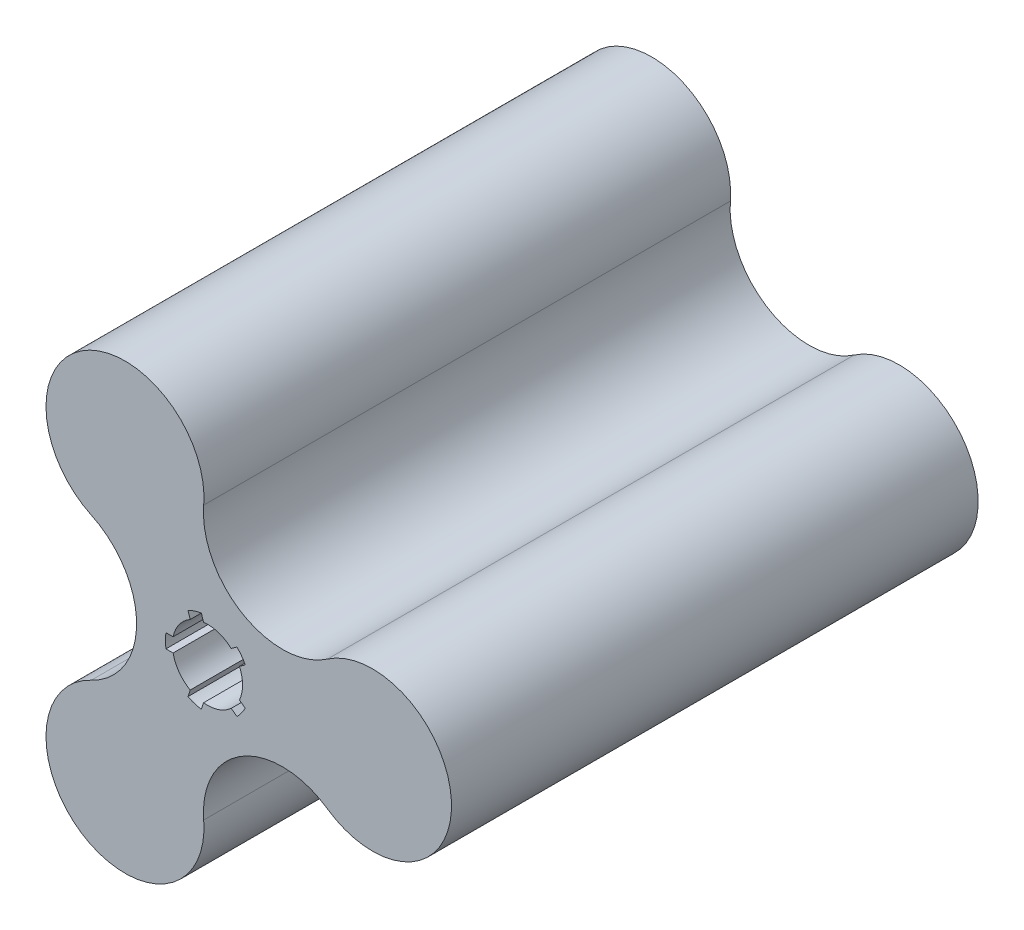
ISO-10303-21;
HEADER;
FILE_DESCRIPTION(('STEP AP214'),'2;1');
FILE_NAME('part.step','',(''),(''),'','','');
FILE_SCHEMA(('AUTOMOTIVE_DESIGN { 1 0 10303 214 1 1 1 1 }'));
ENDSEC;
DATA;
#1=APPLICATION_CONTEXT('core data for automotive mechanical design processes');
#2=APPLICATION_PROTOCOL_DEFINITION('international standard','automotive_design',2000,#1);
#3=PRODUCT_CONTEXT('',#1,'mechanical');
#4=PRODUCT('Part','Part','',(#3));
#5=PRODUCT_RELATED_PRODUCT_CATEGORY('part','',(#4));
#6=PRODUCT_DEFINITION_FORMATION('','',#4);
#7=PRODUCT_DEFINITION_CONTEXT('part definition',#1,'design');
#8=PRODUCT_DEFINITION('design','',#6,#7);
#9=PRODUCT_DEFINITION_SHAPE('','',#8);
#10=(LENGTH_UNIT() NAMED_UNIT(*) SI_UNIT(.MILLI.,.METRE.));
#11=(NAMED_UNIT(*) PLANE_ANGLE_UNIT() SI_UNIT($,.RADIAN.));
#12=(NAMED_UNIT(*) SI_UNIT($,.STERADIAN.) SOLID_ANGLE_UNIT());
#13=UNCERTAINTY_MEASURE_WITH_UNIT(LENGTH_MEASURE(1.E-05),#10,'distance_accuracy_value','');
#14=(GEOMETRIC_REPRESENTATION_CONTEXT(3) GLOBAL_UNCERTAINTY_ASSIGNED_CONTEXT((#13)) GLOBAL_UNIT_ASSIGNED_CONTEXT((#10,
#11,#12)) REPRESENTATION_CONTEXT('',''));
#15=CARTESIAN_POINT('',(0.,0.,0.));
#16=DIRECTION('',(0.,0.,1.));
#17=DIRECTION('',(1.,0.,0.));
#18=AXIS2_PLACEMENT_3D('',#15,#16,#17);
#19=CARTESIAN_POINT('',(47.,0.,-150.));
#20=DIRECTION('',(0.,0.,1.));
#21=DIRECTION('',(1.,0.,0.));
#22=AXIS2_PLACEMENT_3D('',#19,#20,#21);
#23=CYLINDRICAL_SURFACE('',#22,22.5);
#24=CARTESIAN_POINT('',(47.,0.,0.));
#25=DIRECTION('',(0.,0.,1.));
#26=DIRECTION('',(1.,0.,0.));
#27=AXIS2_PLACEMENT_3D('',#24,#25,#26);
#28=CIRCLE('',#27,22.5);
#29=CARTESIAN_POINT('',(34.1724602655989,-18.4852434217773,0.));
#30=VERTEX_POINT('',#29);
#31=CARTESIAN_POINT('',(34.1724602655988,18.4852434217772,0.));
#32=VERTEX_POINT('',#31);
#33=EDGE_CURVE('E313',#30,#32,#28,.T.);
#34=ORIENTED_EDGE('',*,*,#33,.F.);
#35=DIRECTION('',(0.,0.,1.));
#36=VECTOR('',#35,1.);
#37=CARTESIAN_POINT('',(34.1724602655989,-18.4852434217773,-150.));
#38=LINE('',#37,#36);
#39=CARTESIAN_POINT('',(34.1724602655989,-18.4852434217773,-150.));
#40=VERTEX_POINT('',#39);
#41=EDGE_CURVE('E11',#40,#30,#38,.T.);
#42=ORIENTED_EDGE('',*,*,#41,.F.);
#43=CARTESIAN_POINT('',(47.,0.,-150.));
#44=DIRECTION('',(0.,0.,1.));
#45=DIRECTION('',(1.,0.,0.));
#46=AXIS2_PLACEMENT_3D('',#43,#44,#45);
#47=CIRCLE('',#46,22.5);
#48=CARTESIAN_POINT('',(34.1724602655988,18.4852434217772,-150.));
#49=VERTEX_POINT('',#48);
#50=EDGE_CURVE('E572',#40,#49,#47,.T.);
#51=ORIENTED_EDGE('',*,*,#50,.T.);
#52=DIRECTION('',(0.,0.,1.));
#53=VECTOR('',#52,1.);
#54=CARTESIAN_POINT('',(34.1724602655988,18.4852434217772,-150.));
#55=LINE('',#54,#53);
#56=EDGE_CURVE('E342',#49,#32,#55,.T.);
#57=ORIENTED_EDGE('',*,*,#56,.T.);
#58=EDGE_LOOP('',(#34,#42,#51,#57));
#59=FACE_BOUND('',#58,.T.);
#60=ADVANCED_FACE('F45',(#59),#23,.T.);
#61=CARTESIAN_POINT('',(21.3449205311978,-36.9704868435546,-150.));
#62=DIRECTION('',(0.,0.,1.));
#63=DIRECTION('',(1.,0.,0.));
#64=AXIS2_PLACEMENT_3D('',#61,#62,#63);
#65=CYLINDRICAL_SURFACE('',#64,22.5);
#66=CARTESIAN_POINT('',(21.3449205311978,-36.9704868435546,0.));
#67=DIRECTION('',(0.,0.,1.));
#68=DIRECTION('',(1.,0.,0.));
#69=AXIS2_PLACEMENT_3D('',#66,#67,#68);
#70=CIRCLE('',#69,22.5);
#71=CARTESIAN_POINT('',(-1.07753973440112,-38.8368404107116,0.));
#72=VERTEX_POINT('',#71);
#73=EDGE_CURVE('E330',#72,#30,#70,.F.);
#74=ORIENTED_EDGE('',*,*,#73,.F.);
#75=DIRECTION('',(0.,0.,1.));
#76=VECTOR('',#75,1.);
#77=CARTESIAN_POINT('',(-1.07753973440112,-38.8368404107116,-150.));
#78=LINE('',#77,#76);
#79=CARTESIAN_POINT('',(-1.07753973440112,-38.8368404107116,-150.));
#80=VERTEX_POINT('',#79);
#81=EDGE_CURVE('E56',#80,#72,#78,.T.);
#82=ORIENTED_EDGE('',*,*,#81,.F.);
#83=CARTESIAN_POINT('',(21.3449205311978,-36.9704868435546,-150.));
#84=DIRECTION('',(0.,0.,1.));
#85=DIRECTION('',(1.,0.,0.));
#86=AXIS2_PLACEMENT_3D('',#83,#84,#85);
#87=CIRCLE('',#86,22.5);
#88=EDGE_CURVE('E247',#80,#40,#87,.F.);
#89=ORIENTED_EDGE('',*,*,#88,.T.);
#90=ORIENTED_EDGE('',*,*,#41,.T.);
#91=EDGE_LOOP('',(#74,#82,#89,#90));
#92=FACE_BOUND('',#91,.T.);
#93=ADVANCED_FACE('F439',(#92),#65,.F.);
#94=CARTESIAN_POINT('',(-23.5,-40.7031939778687,-150.));
#95=DIRECTION('',(0.,0.,1.));
#96=DIRECTION('',(1.,0.,0.));
#97=AXIS2_PLACEMENT_3D('',#94,#95,#96);
#98=CYLINDRICAL_SURFACE('',#97,22.5);
#99=CARTESIAN_POINT('',(-23.5,-40.7031939778687,0.));
#100=DIRECTION('',(0.,0.,1.));
#101=DIRECTION('',(1.,0.,0.));
#102=AXIS2_PLACEMENT_3D('',#99,#100,#101);
#103=CIRCLE('',#102,22.5);
#104=CARTESIAN_POINT('',(-33.0949205311977,-20.3515969889344,0.));
#105=VERTEX_POINT('',#104);
#106=EDGE_CURVE('E230',#105,#72,#103,.T.);
#107=ORIENTED_EDGE('',*,*,#106,.F.);
#108=DIRECTION('',(0.,0.,1.));
#109=VECTOR('',#108,1.);
#110=CARTESIAN_POINT('',(-33.0949205311977,-20.3515969889344,-150.));
#111=LINE('',#110,#109);
#112=CARTESIAN_POINT('',(-33.0949205311977,-20.3515969889344,-150.));
#113=VERTEX_POINT('',#112);
#114=EDGE_CURVE('E224',#113,#105,#111,.T.);
#115=ORIENTED_EDGE('',*,*,#114,.F.);
#116=CARTESIAN_POINT('',(-23.5,-40.7031939778687,-150.));
#117=DIRECTION('',(0.,0.,1.));
#118=DIRECTION('',(1.,0.,0.));
#119=AXIS2_PLACEMENT_3D('',#116,#117,#118);
#120=CIRCLE('',#119,22.5);
#121=EDGE_CURVE('E228',#113,#80,#120,.T.);
#122=ORIENTED_EDGE('',*,*,#121,.T.);
#123=ORIENTED_EDGE('',*,*,#81,.T.);
#124=EDGE_LOOP('',(#107,#115,#122,#123));
#125=FACE_BOUND('',#124,.T.);
#126=ADVANCED_FACE('F226',(#125),#98,.T.);
#127=CARTESIAN_POINT('',(-42.6898410623955,0.,-150.));
#128=DIRECTION('',(0.,0.,1.));
#129=DIRECTION('',(1.,0.,0.));
#130=AXIS2_PLACEMENT_3D('',#127,#128,#129);
#131=CYLINDRICAL_SURFACE('',#130,22.5);
#132=CARTESIAN_POINT('',(-42.6898410623955,0.,0.));
#133=DIRECTION('',(0.,0.,1.));
#134=DIRECTION('',(1.,0.,0.));
#135=AXIS2_PLACEMENT_3D('',#132,#133,#134);
#136=CIRCLE('',#135,22.5);
#137=CARTESIAN_POINT('',(-33.0949205311978,20.3515969889343,0.));
#138=VERTEX_POINT('',#137);
#139=EDGE_CURVE('E325',#105,#138,#136,.T.);
#140=ORIENTED_EDGE('',*,*,#139,.T.);
#141=DIRECTION('',(0.,0.,1.));
#142=VECTOR('',#141,1.);
#143=CARTESIAN_POINT('',(-33.0949205311978,20.3515969889343,-150.));
#144=LINE('',#143,#142);
#145=CARTESIAN_POINT('',(-33.0949205311978,20.3515969889343,-150.));
#146=VERTEX_POINT('',#145);
#147=EDGE_CURVE('E235',#146,#138,#144,.T.);
#148=ORIENTED_EDGE('',*,*,#147,.F.);
#149=CARTESIAN_POINT('',(-42.6898410623955,0.,-150.));
#150=DIRECTION('',(0.,0.,1.));
#151=DIRECTION('',(1.,0.,0.));
#152=AXIS2_PLACEMENT_3D('',#149,#150,#151);
#153=CIRCLE('',#152,22.5);
#154=EDGE_CURVE('E238',#113,#146,#153,.T.);
#155=ORIENTED_EDGE('',*,*,#154,.F.);
#156=ORIENTED_EDGE('',*,*,#114,.T.);
#157=EDGE_LOOP('',(#140,#148,#155,#156));
#158=FACE_BOUND('',#157,.T.);
#159=ADVANCED_FACE('F239',(#158),#131,.F.);
#160=CARTESIAN_POINT('',(-23.5000000000001,40.7031939778686,-150.));
#161=DIRECTION('',(0.,0.,1.));
#162=DIRECTION('',(1.,0.,0.));
#163=AXIS2_PLACEMENT_3D('',#160,#161,#162);
#164=CYLINDRICAL_SURFACE('',#163,22.5);
#165=CARTESIAN_POINT('',(-23.5000000000001,40.7031939778686,0.));
#166=DIRECTION('',(0.,0.,1.));
#167=DIRECTION('',(1.,0.,0.));
#168=AXIS2_PLACEMENT_3D('',#165,#166,#167);
#169=CIRCLE('',#168,22.5);
#170=CARTESIAN_POINT('',(-1.0775397344012,38.8368404107115,0.));
#171=VERTEX_POINT('',#170);
#172=EDGE_CURVE('E321',#171,#138,#169,.T.);
#173=ORIENTED_EDGE('',*,*,#172,.F.);
#174=DIRECTION('',(0.,0.,1.));
#175=VECTOR('',#174,1.);
#176=CARTESIAN_POINT('',(-1.0775397344012,38.8368404107115,-150.));
#177=LINE('',#176,#175);
#178=CARTESIAN_POINT('',(-1.0775397344012,38.8368404107115,-150.));
#179=VERTEX_POINT('',#178);
#180=EDGE_CURVE('E339',#179,#171,#177,.T.);
#181=ORIENTED_EDGE('',*,*,#180,.F.);
#182=CARTESIAN_POINT('',(-23.5000000000001,40.7031939778686,-150.));
#183=DIRECTION('',(0.,0.,1.));
#184=DIRECTION('',(1.,0.,0.));
#185=AXIS2_PLACEMENT_3D('',#182,#183,#184);
#186=CIRCLE('',#185,22.5);
#187=EDGE_CURVE('E244',#179,#146,#186,.T.);
#188=ORIENTED_EDGE('',*,*,#187,.T.);
#189=ORIENTED_EDGE('',*,*,#147,.T.);
#190=EDGE_LOOP('',(#173,#181,#188,#189));
#191=FACE_BOUND('',#190,.T.);
#192=ADVANCED_FACE('F581',(#191),#164,.T.);
#193=CARTESIAN_POINT('',(0.,0.,-150.));
#194=DIRECTION('',(0.,0.,1.));
#195=DIRECTION('',(1.,0.,0.));
#196=AXIS2_PLACEMENT_3D('',#193,#194,#195);
#197=CYLINDRICAL_SURFACE('',#196,12.);
#198=CARTESIAN_POINT('',(0.,0.,0.));
#199=DIRECTION('',(0.,0.,1.));
#200=DIRECTION('',(1.,0.,0.));
#201=AXIS2_PLACEMENT_3D('',#198,#199,#200);
#202=CIRCLE('',#201,12.);
#203=CARTESIAN_POINT('',(-5.5584514187021,-10.6350184685279,0.));
#204=VERTEX_POINT('',#203);
#205=CARTESIAN_POINT('',(-1.7542253535215,-11.8710864460277,0.));
#206=VERTEX_POINT('',#205);
#207=EDGE_CURVE('E254',#204,#206,#202,.T.);
#208=ORIENTED_EDGE('',*,*,#207,.T.);
#209=DIRECTION('',(0.,0.,1.));
#210=VECTOR('',#209,1.);
#211=CARTESIAN_POINT('',(-1.7542253535215,-11.8710864460277,-150.));
#212=LINE('',#211,#210);
#213=CARTESIAN_POINT('',(-1.7542253535215,-11.8710864460277,-150.));
#214=VERTEX_POINT('',#213);
#215=EDGE_CURVE('E345',#214,#206,#212,.T.);
#216=ORIENTED_EDGE('',*,*,#215,.F.);
#217=CARTESIAN_POINT('',(0.,0.,-150.));
#218=DIRECTION('',(0.,0.,1.));
#219=DIRECTION('',(1.,0.,0.));
#220=AXIS2_PLACEMENT_3D('',#217,#218,#219);
#221=CIRCLE('',#220,12.);
#222=CARTESIAN_POINT('',(-5.5584514187021,-10.6350184685279,-150.));
#223=VERTEX_POINT('',#222);
#224=EDGE_CURVE('E333',#223,#214,#221,.T.);
#225=ORIENTED_EDGE('',*,*,#224,.F.);
#226=DIRECTION('',(0.,0.,1.));
#227=VECTOR('',#226,1.);
#228=CARTESIAN_POINT('',(-5.5584514187021,-10.6350184685279,-150.));
#229=LINE('',#228,#227);
#230=EDGE_CURVE('E49',#223,#204,#229,.T.);
#231=ORIENTED_EDGE('',*,*,#230,.T.);
#232=EDGE_LOOP('',(#208,#216,#225,#231));
#233=FACE_BOUND('',#232,.T.);
#234=ADVANCED_FACE('F47',(#233),#197,.F.);
#235=CARTESIAN_POINT('',(1.9021130325903,-0.618033988749915,-150.));
#236=DIRECTION('',(0.95105651629515,-0.309016994374958,0.));
#237=DIRECTION('',(0.309016994374958,0.95105651629515,0.));
#238=AXIS2_PLACEMENT_3D('',#235,#236,#237);
#239=PLANE('',#238);
#240=DIRECTION('',(0.309016994374958,0.95105651629515,0.));
#241=VECTOR('',#240,1.);
#242=CARTESIAN_POINT('',(1.9021130325903,-0.618033988749915,0.));
#243=LINE('',#242,#241);
#244=CARTESIAN_POINT('',(-1.12562279967829,-9.93644671463821,0.));
#245=VERTEX_POINT('',#244);
#246=EDGE_CURVE('E310',#206,#245,#243,.T.);
#247=ORIENTED_EDGE('',*,*,#246,.T.);
#248=DIRECTION('',(0.,0.,1.));
#249=VECTOR('',#248,1.);
#250=CARTESIAN_POINT('',(-1.12562279967829,-9.93644671463821,-150.));
#251=LINE('',#250,#249);
#252=CARTESIAN_POINT('',(-1.12562279967829,-9.93644671463821,-150.));
#253=VERTEX_POINT('',#252);
#254=EDGE_CURVE('E349',#253,#245,#251,.T.);
#255=ORIENTED_EDGE('',*,*,#254,.F.);
#256=DIRECTION('',(0.309016994374958,0.95105651629515,0.));
#257=VECTOR('',#256,1.);
#258=CARTESIAN_POINT('',(1.9021130325903,-0.618033988749915,-150.));
#259=LINE('',#258,#257);
#260=EDGE_CURVE('E522',#214,#253,#259,.T.);
#261=ORIENTED_EDGE('',*,*,#260,.F.);
#262=ORIENTED_EDGE('',*,*,#215,.T.);
#263=EDGE_LOOP('',(#247,#255,#261,#262));
#264=FACE_BOUND('',#263,.T.);
#265=ADVANCED_FACE('F447',(#264),#239,.F.);
#266=CARTESIAN_POINT('',(0.,0.,-150.));
#267=DIRECTION('',(0.,0.,1.));
#268=DIRECTION('',(1.,0.,0.));
#269=AXIS2_PLACEMENT_3D('',#266,#267,#268);
#270=CYLINDRICAL_SURFACE('',#269,10.);
#271=CARTESIAN_POINT('',(0.,0.,0.));
#272=DIRECTION('',(0.,0.,1.));
#273=DIRECTION('',(1.,0.,0.));
#274=AXIS2_PLACEMENT_3D('',#271,#272,#273);
#275=CIRCLE('',#274,10.);
#276=CARTESIAN_POINT('',(6.75114481324983,-7.3771297745485,0.));
#277=VERTEX_POINT('',#276);
#278=EDGE_CURVE('E267',#245,#277,#275,.T.);
#279=ORIENTED_EDGE('',*,*,#278,.T.);
#280=DIRECTION('',(0.,0.,1.));
#281=VECTOR('',#280,1.);
#282=CARTESIAN_POINT('',(6.75114481324983,-7.3771297745485,-150.));
#283=LINE('',#282,#281);
#284=CARTESIAN_POINT('',(6.75114481324983,-7.3771297745485,-150.));
#285=VERTEX_POINT('',#284);
#286=EDGE_CURVE('E353',#285,#277,#283,.T.);
#287=ORIENTED_EDGE('',*,*,#286,.F.);
#288=CARTESIAN_POINT('',(0.,0.,-150.));
#289=DIRECTION('',(0.,0.,1.));
#290=DIRECTION('',(1.,0.,0.));
#291=AXIS2_PLACEMENT_3D('',#288,#289,#290);
#292=CIRCLE('',#291,10.);
#293=EDGE_CURVE('E514',#253,#285,#292,.T.);
#294=ORIENTED_EDGE('',*,*,#293,.F.);
#295=ORIENTED_EDGE('',*,*,#254,.T.);
#296=EDGE_LOOP('',(#279,#287,#294,#295));
#297=FACE_BOUND('',#296,.T.);
#298=ADVANCED_FACE('F436',(#297),#270,.F.);
#299=CARTESIAN_POINT('',(-1.17557050458496,-1.61803398874989,-150.));
#300=DIRECTION('',(0.58778525229248,0.809016994374942,0.));
#301=DIRECTION('',(-0.809016994374943,0.58778525229248,0.));
#302=AXIS2_PLACEMENT_3D('',#299,#300,#301);
#303=PLANE('',#302);
#304=DIRECTION('',(-0.809016994374943,0.58778525229248,0.));
#305=VECTOR('',#304,1.);
#306=CARTESIAN_POINT('',(-1.17557050458496,-1.61803398874989,0.));
#307=LINE('',#306,#305);
#308=CARTESIAN_POINT('',(8.39684766462627,-8.57280288453319,0.));
#309=VERTEX_POINT('',#308);
#310=EDGE_CURVE('E306',#309,#277,#307,.T.);
#311=ORIENTED_EDGE('',*,*,#310,.F.);
#312=DIRECTION('',(0.,0.,1.));
#313=VECTOR('',#312,1.);
#314=CARTESIAN_POINT('',(8.39684766462627,-8.57280288453319,-150.));
#315=LINE('',#314,#313);
#316=CARTESIAN_POINT('',(8.39684766462627,-8.57280288453319,-150.));
#317=VERTEX_POINT('',#316);
#318=EDGE_CURVE('E356',#317,#309,#315,.T.);
#319=ORIENTED_EDGE('',*,*,#318,.F.);
#320=DIRECTION('',(-0.809016994374943,0.58778525229248,0.));
#321=VECTOR('',#320,1.);
#322=CARTESIAN_POINT('',(-1.17557050458496,-1.61803398874989,-150.));
#323=LINE('',#322,#321);
#324=EDGE_CURVE('E523',#317,#285,#323,.T.);
#325=ORIENTED_EDGE('',*,*,#324,.T.);
#326=ORIENTED_EDGE('',*,*,#286,.T.);
#327=EDGE_LOOP('',(#311,#319,#325,#326));
#328=FACE_BOUND('',#327,.T.);
#329=ADVANCED_FACE('F452',(#328),#303,.T.);
#330=CARTESIAN_POINT('',(0.,0.,-150.));
#331=DIRECTION('',(0.,0.,1.));
#332=DIRECTION('',(1.,0.,0.));
#333=AXIS2_PLACEMENT_3D('',#330,#331,#332);
#334=CYLINDRICAL_SURFACE('',#333,12.);
#335=CARTESIAN_POINT('',(0.,0.,0.));
#336=DIRECTION('',(0.,0.,1.));
#337=DIRECTION('',(1.,0.,0.));
#338=AXIS2_PLACEMENT_3D('',#335,#336,#337);
#339=CIRCLE('',#338,12.);
#340=CARTESIAN_POINT('',(10.7479886737962,-5.33673490703342,0.));
#341=VERTEX_POINT('',#340);
#342=EDGE_CURVE('E303',#309,#341,#339,.T.);
#343=ORIENTED_EDGE('',*,*,#342,.T.);
#344=DIRECTION('',(0.,0.,1.));
#345=VECTOR('',#344,1.);
#346=CARTESIAN_POINT('',(10.7479886737962,-5.33673490703342,-150.));
#347=LINE('',#346,#345);
#348=CARTESIAN_POINT('',(10.7479886737962,-5.33673490703342,-150.));
#349=VERTEX_POINT('',#348);
#350=EDGE_CURVE('E359',#349,#341,#347,.T.);
#351=ORIENTED_EDGE('',*,*,#350,.F.);
#352=CARTESIAN_POINT('',(0.,0.,-150.));
#353=DIRECTION('',(0.,0.,1.));
#354=DIRECTION('',(1.,0.,0.));
#355=AXIS2_PLACEMENT_3D('',#352,#353,#354);
#356=CIRCLE('',#355,12.);
#357=EDGE_CURVE('E558',#317,#349,#356,.T.);
#358=ORIENTED_EDGE('',*,*,#357,.F.);
#359=ORIENTED_EDGE('',*,*,#318,.T.);
#360=EDGE_LOOP('',(#343,#351,#358,#359));
#361=FACE_BOUND('',#360,.T.);
#362=ADVANCED_FACE('F457',(#361),#334,.F.);
#363=CARTESIAN_POINT('',(1.17557050458496,1.61803398874988,-150.));
#364=DIRECTION('',(0.58778525229248,0.809016994374942,0.));
#365=DIRECTION('',(-0.809016994374942,0.58778525229248,0.));
#366=AXIS2_PLACEMENT_3D('',#363,#364,#365);
#367=PLANE('',#366);
#368=DIRECTION('',(-0.809016994374942,0.58778525229248,0.));
#369=VECTOR('',#368,1.);
#370=CARTESIAN_POINT('',(1.17557050458496,1.61803398874988,0.));
#371=LINE('',#370,#369);
#372=CARTESIAN_POINT('',(9.10228582241975,-4.14106179704873,0.));
#373=VERTEX_POINT('',#372);
#374=EDGE_CURVE('E300',#341,#373,#371,.T.);
#375=ORIENTED_EDGE('',*,*,#374,.T.);
#376=DIRECTION('',(0.,0.,1.));
#377=VECTOR('',#376,1.);
#378=CARTESIAN_POINT('',(9.10228582241975,-4.14106179704873,-150.));
#379=LINE('',#378,#377);
#380=CARTESIAN_POINT('',(9.10228582241975,-4.14106179704873,-150.));
#381=VERTEX_POINT('',#380);
#382=EDGE_CURVE('E363',#381,#373,#379,.T.);
#383=ORIENTED_EDGE('',*,*,#382,.F.);
#384=DIRECTION('',(-0.809016994374942,0.58778525229248,0.));
#385=VECTOR('',#384,1.);
#386=CARTESIAN_POINT('',(1.17557050458496,1.61803398874988,-150.));
#387=LINE('',#386,#385);
#388=EDGE_CURVE('E551',#349,#381,#387,.T.);
#389=ORIENTED_EDGE('',*,*,#388,.F.);
#390=ORIENTED_EDGE('',*,*,#350,.T.);
#391=EDGE_LOOP('',(#375,#383,#389,#390));
#392=FACE_BOUND('',#391,.T.);
#393=ADVANCED_FACE('F461',(#392),#367,.F.);
#394=CARTESIAN_POINT('',(9.10228582241981,4.1410617970486,0.));
#395=VERTEX_POINT('',#394);
#396=EDGE_CURVE('E299',#373,#395,#275,.T.);
#397=ORIENTED_EDGE('',*,*,#396,.T.);
#398=DIRECTION('',(0.,0.,1.));
#399=VECTOR('',#398,1.);
#400=CARTESIAN_POINT('',(9.10228582241981,4.1410617970486,-150.));
#401=LINE('',#400,#399);
#402=CARTESIAN_POINT('',(9.10228582241981,4.1410617970486,-150.));
#403=VERTEX_POINT('',#402);
#404=EDGE_CURVE('E367',#403,#395,#401,.T.);
#405=ORIENTED_EDGE('',*,*,#404,.F.);
#406=EDGE_CURVE('E524',#381,#403,#292,.T.);
#407=ORIENTED_EDGE('',*,*,#406,.F.);
#408=ORIENTED_EDGE('',*,*,#382,.T.);
#409=EDGE_LOOP('',(#397,#405,#407,#408));
#410=FACE_BOUND('',#409,.T.);
#411=ADVANCED_FACE('F454',(#410),#270,.F.);
#412=CARTESIAN_POINT('',(1.17557050458494,-1.6180339887499,-150.));
#413=DIRECTION('',(-0.587785252292469,0.809016994374951,0.));
#414=DIRECTION('',(-0.809016994374951,-0.587785252292469,0.));
#415=AXIS2_PLACEMENT_3D('',#412,#413,#414);
#416=PLANE('',#415);
#417=DIRECTION('',(-0.809016994374951,-0.587785252292469,0.));
#418=VECTOR('',#417,1.);
#419=CARTESIAN_POINT('',(1.17557050458494,-1.6180339887499,0.));
#420=LINE('',#419,#418);
#421=CARTESIAN_POINT('',(10.7479886737963,5.33673490703326,0.));
#422=VERTEX_POINT('',#421);
#423=EDGE_CURVE('E295',#422,#395,#420,.T.);
#424=ORIENTED_EDGE('',*,*,#423,.F.);
#425=DIRECTION('',(0.,0.,1.));
#426=VECTOR('',#425,1.);
#427=CARTESIAN_POINT('',(10.7479886737963,5.33673490703326,-150.));
#428=LINE('',#427,#426);
#429=CARTESIAN_POINT('',(10.7479886737963,5.33673490703326,-150.));
#430=VERTEX_POINT('',#429);
#431=EDGE_CURVE('E370',#430,#422,#428,.T.);
#432=ORIENTED_EDGE('',*,*,#431,.F.);
#433=DIRECTION('',(-0.809016994374951,-0.587785252292469,0.));
#434=VECTOR('',#433,1.);
#435=CARTESIAN_POINT('',(1.17557050458494,-1.6180339887499,-150.));
#436=LINE('',#435,#434);
#437=EDGE_CURVE('E552',#430,#403,#436,.T.);
#438=ORIENTED_EDGE('',*,*,#437,.T.);
#439=ORIENTED_EDGE('',*,*,#404,.T.);
#440=EDGE_LOOP('',(#424,#432,#438,#439));
#441=FACE_BOUND('',#440,.T.);
#442=ADVANCED_FACE('F466',(#441),#416,.T.);
#443=CARTESIAN_POINT('',(0.,0.,-150.));
#444=DIRECTION('',(0.,0.,1.));
#445=DIRECTION('',(1.,0.,0.));
#446=AXIS2_PLACEMENT_3D('',#443,#444,#445);
#447=CYLINDRICAL_SURFACE('',#446,12.);
#448=CARTESIAN_POINT('',(0.,0.,0.));
#449=DIRECTION('',(0.,0.,1.));
#450=DIRECTION('',(1.,0.,0.));
#451=AXIS2_PLACEMENT_3D('',#448,#449,#450);
#452=CIRCLE('',#451,12.);
#453=CARTESIAN_POINT('',(8.39684766462639,8.57280288453306,0.));
#454=VERTEX_POINT('',#453);
#455=EDGE_CURVE('E292',#422,#454,#452,.T.);
#456=ORIENTED_EDGE('',*,*,#455,.T.);
#457=DIRECTION('',(0.,0.,1.));
#458=VECTOR('',#457,1.);
#459=CARTESIAN_POINT('',(8.39684766462639,8.57280288453306,-150.));
#460=LINE('',#459,#458);
#461=CARTESIAN_POINT('',(8.39684766462639,8.57280288453306,-150.));
#462=VERTEX_POINT('',#461);
#463=EDGE_CURVE('E373',#462,#454,#460,.T.);
#464=ORIENTED_EDGE('',*,*,#463,.F.);
#465=CARTESIAN_POINT('',(0.,0.,-150.));
#466=DIRECTION('',(0.,0.,1.));
#467=DIRECTION('',(1.,0.,0.));
#468=AXIS2_PLACEMENT_3D('',#465,#466,#467);
#469=CIRCLE('',#468,12.);
#470=EDGE_CURVE('E546',#430,#462,#469,.T.);
#471=ORIENTED_EDGE('',*,*,#470,.F.);
#472=ORIENTED_EDGE('',*,*,#431,.T.);
#473=EDGE_LOOP('',(#456,#464,#471,#472));
#474=FACE_BOUND('',#473,.T.);
#475=ADVANCED_FACE('F469',(#474),#447,.F.);
#476=CARTESIAN_POINT('',(-1.17557050458494,1.61803398874991,-150.));
#477=DIRECTION('',(-0.587785252292468,0.809016994374951,0.));
#478=DIRECTION('',(-0.809016994374951,-0.587785252292468,0.));
#479=AXIS2_PLACEMENT_3D('',#476,#477,#478);
#480=PLANE('',#479);
#481=DIRECTION('',(-0.809016994374951,-0.587785252292468,0.));
#482=VECTOR('',#481,1.);
#483=CARTESIAN_POINT('',(-1.17557050458494,1.61803398874991,0.));
#484=LINE('',#483,#482);
#485=CARTESIAN_POINT('',(6.75114481324994,7.3771297745484,0.));
#486=VERTEX_POINT('',#485);
#487=EDGE_CURVE('E289',#454,#486,#484,.T.);
#488=ORIENTED_EDGE('',*,*,#487,.T.);
#489=DIRECTION('',(0.,0.,1.));
#490=VECTOR('',#489,1.);
#491=CARTESIAN_POINT('',(6.75114481324994,7.3771297745484,-150.));
#492=LINE('',#491,#490);
#493=CARTESIAN_POINT('',(6.75114481324994,7.3771297745484,-150.));
#494=VERTEX_POINT('',#493);
#495=EDGE_CURVE('E377',#494,#486,#492,.T.);
#496=ORIENTED_EDGE('',*,*,#495,.F.);
#497=DIRECTION('',(-0.809016994374951,-0.587785252292468,0.));
#498=VECTOR('',#497,1.);
#499=CARTESIAN_POINT('',(-1.17557050458494,1.61803398874991,-150.));
#500=LINE('',#499,#498);
#501=EDGE_CURVE('E539',#462,#494,#500,.T.);
#502=ORIENTED_EDGE('',*,*,#501,.F.);
#503=ORIENTED_EDGE('',*,*,#463,.T.);
#504=EDGE_LOOP('',(#488,#496,#502,#503));
#505=FACE_BOUND('',#504,.T.);
#506=ADVANCED_FACE('F473',(#505),#480,.F.);
#507=CARTESIAN_POINT('',(-1.12562279967815,9.93644671463823,0.));
#508=VERTEX_POINT('',#507);
#509=EDGE_CURVE('E288',#486,#508,#275,.T.);
#510=ORIENTED_EDGE('',*,*,#509,.T.);
#511=DIRECTION('',(0.,0.,1.));
#512=VECTOR('',#511,1.);
#513=CARTESIAN_POINT('',(-1.12562279967815,9.93644671463823,-150.));
#514=LINE('',#513,#512);
#515=CARTESIAN_POINT('',(-1.12562279967815,9.93644671463823,-150.));
#516=VERTEX_POINT('',#515);
#517=EDGE_CURVE('E381',#516,#508,#514,.T.);
#518=ORIENTED_EDGE('',*,*,#517,.F.);
#519=EDGE_CURVE('E528',#494,#516,#292,.T.);
#520=ORIENTED_EDGE('',*,*,#519,.F.);
#521=ORIENTED_EDGE('',*,*,#495,.T.);
#522=EDGE_LOOP('',(#510,#518,#520,#521));
#523=FACE_BOUND('',#522,.T.);
#524=ADVANCED_FACE('F477',(#523),#270,.F.);
#525=CARTESIAN_POINT('',(1.90211303259031,0.61803398874989,-150.));
#526=DIRECTION('',(-0.951056516295154,-0.309016994374945,0.));
#527=DIRECTION('',(0.309016994374945,-0.951056516295155,0.));
#528=AXIS2_PLACEMENT_3D('',#525,#526,#527);
#529=PLANE('',#528);
#530=DIRECTION('',(0.309016994374945,-0.951056516295155,0.));
#531=VECTOR('',#530,1.);
#532=CARTESIAN_POINT('',(1.90211303259031,0.61803398874989,0.));
#533=LINE('',#532,#531);
#534=CARTESIAN_POINT('',(-1.75422535352133,11.8710864460277,0.));
#535=VERTEX_POINT('',#534);
#536=EDGE_CURVE('E284',#535,#508,#533,.T.);
#537=ORIENTED_EDGE('',*,*,#536,.F.);
#538=DIRECTION('',(0.,0.,1.));
#539=VECTOR('',#538,1.);
#540=CARTESIAN_POINT('',(-1.75422535352133,11.8710864460277,-150.));
#541=LINE('',#540,#539);
#542=CARTESIAN_POINT('',(-1.75422535352133,11.8710864460277,-150.));
#543=VERTEX_POINT('',#542);
#544=EDGE_CURVE('E384',#543,#535,#541,.T.);
#545=ORIENTED_EDGE('',*,*,#544,.F.);
#546=DIRECTION('',(0.309016994374945,-0.951056516295155,0.));
#547=VECTOR('',#546,1.);
#548=CARTESIAN_POINT('',(1.90211303259031,0.61803398874989,-150.));
#549=LINE('',#548,#547);
#550=EDGE_CURVE('E540',#543,#516,#549,.T.);
#551=ORIENTED_EDGE('',*,*,#550,.T.);
#552=ORIENTED_EDGE('',*,*,#517,.T.);
#553=EDGE_LOOP('',(#537,#545,#551,#552));
#554=FACE_BOUND('',#553,.T.);
#555=ADVANCED_FACE('F479',(#554),#529,.T.);
#556=CARTESIAN_POINT('',(0.,0.,-150.));
#557=DIRECTION('',(0.,0.,1.));
#558=DIRECTION('',(1.,0.,0.));
#559=AXIS2_PLACEMENT_3D('',#556,#557,#558);
#560=CYLINDRICAL_SURFACE('',#559,12.);
#561=CARTESIAN_POINT('',(0.,0.,0.));
#562=DIRECTION('',(0.,0.,1.));
#563=DIRECTION('',(1.,0.,0.));
#564=AXIS2_PLACEMENT_3D('',#561,#562,#563);
#565=CIRCLE('',#564,12.);
#566=CARTESIAN_POINT('',(-5.55845141870195,10.6350184685279,0.));
#567=VERTEX_POINT('',#566);
#568=EDGE_CURVE('E281',#535,#567,#565,.T.);
#569=ORIENTED_EDGE('',*,*,#568,.T.);
#570=DIRECTION('',(0.,0.,1.));
#571=VECTOR('',#570,1.);
#572=CARTESIAN_POINT('',(-5.55845141870195,10.6350184685279,-150.));
#573=LINE('',#572,#571);
#574=CARTESIAN_POINT('',(-5.55845141870195,10.6350184685279,-150.));
#575=VERTEX_POINT('',#574);
#576=EDGE_CURVE('E387',#575,#567,#573,.T.);
#577=ORIENTED_EDGE('',*,*,#576,.F.);
#578=CARTESIAN_POINT('',(0.,0.,-150.));
#579=DIRECTION('',(0.,0.,1.));
#580=DIRECTION('',(1.,0.,0.));
#581=AXIS2_PLACEMENT_3D('',#578,#579,#580);
#582=CIRCLE('',#581,12.);
#583=EDGE_CURVE('E534',#543,#575,#582,.T.);
#584=ORIENTED_EDGE('',*,*,#583,.F.);
#585=ORIENTED_EDGE('',*,*,#544,.T.);
#586=EDGE_LOOP('',(#569,#577,#584,#585));
#587=FACE_BOUND('',#586,.T.);
#588=ADVANCED_FACE('F482',(#587),#560,.F.);
#589=CARTESIAN_POINT('',(-1.90211303259031,-0.618033988749889,-150.));
#590=DIRECTION('',(-0.951056516295154,-0.309016994374945,0.));
#591=DIRECTION('',(0.309016994374945,-0.951056516295155,0.));
#592=AXIS2_PLACEMENT_3D('',#589,#590,#591);
#593=PLANE('',#592);
#594=DIRECTION('',(0.309016994374945,-0.951056516295155,0.));
#595=VECTOR('',#594,1.);
#596=CARTESIAN_POINT('',(-1.90211303259031,-0.618033988749889,0.));
#597=LINE('',#596,#595);
#598=CARTESIAN_POINT('',(-4.92984886485877,8.70037873713845,0.));
#599=VERTEX_POINT('',#598);
#600=EDGE_CURVE('E278',#567,#599,#597,.T.);
#601=ORIENTED_EDGE('',*,*,#600,.T.);
#602=DIRECTION('',(0.,0.,1.));
#603=VECTOR('',#602,1.);
#604=CARTESIAN_POINT('',(-4.92984886485877,8.70037873713845,-150.));
#605=LINE('',#604,#603);
#606=CARTESIAN_POINT('',(-4.92984886485877,8.70037873713845,-150.));
#607=VERTEX_POINT('',#606);
#608=EDGE_CURVE('E391',#607,#599,#605,.T.);
#609=ORIENTED_EDGE('',*,*,#608,.F.);
#610=DIRECTION('',(0.309016994374945,-0.951056516295155,0.));
#611=VECTOR('',#610,1.);
#612=CARTESIAN_POINT('',(-1.90211303259031,-0.618033988749889,-150.));
#613=LINE('',#612,#611);
#614=EDGE_CURVE('E526',#575,#607,#613,.T.);
#615=ORIENTED_EDGE('',*,*,#614,.F.);
#616=ORIENTED_EDGE('',*,*,#576,.T.);
#617=EDGE_LOOP('',(#601,#609,#615,#616));
#618=FACE_BOUND('',#617,.T.);
#619=ADVANCED_FACE('F486',(#618),#593,.F.);
#620=CARTESIAN_POINT('',(-9.79795897113272,2.,0.));
#621=VERTEX_POINT('',#620);
#622=EDGE_CURVE('E268',#599,#621,#275,.T.);
#623=ORIENTED_EDGE('',*,*,#622,.T.);
#624=DIRECTION('',(0.,0.,1.));
#625=VECTOR('',#624,1.);
#626=CARTESIAN_POINT('',(-9.79795897113272,2.,-150.));
#627=LINE('',#626,#625);
#628=CARTESIAN_POINT('',(-9.79795897113272,2.,-150.));
#629=VERTEX_POINT('',#628);
#630=EDGE_CURVE('E395',#629,#621,#627,.T.);
#631=ORIENTED_EDGE('',*,*,#630,.F.);
#632=EDGE_CURVE('E515',#607,#629,#292,.T.);
#633=ORIENTED_EDGE('',*,*,#632,.F.);
#634=ORIENTED_EDGE('',*,*,#608,.T.);
#635=EDGE_LOOP('',(#623,#631,#633,#634));
#636=FACE_BOUND('',#635,.T.);
#637=ADVANCED_FACE('F435',(#636),#270,.F.);
#638=CARTESIAN_POINT('',(0.,2.,-150.));
#639=DIRECTION('',(0.,-1.,0.));
#640=DIRECTION('',(0.,0.,-1.));
#641=AXIS2_PLACEMENT_3D('',#638,#639,#640);
#642=PLANE('',#641);
#643=DIRECTION('',(1.,0.,0.));
#644=VECTOR('',#643,1.);
#645=CARTESIAN_POINT('',(0.,2.,0.));
#646=LINE('',#645,#644);
#647=CARTESIAN_POINT('',(-11.8321595661992,2.,0.));
#648=VERTEX_POINT('',#647);
#649=EDGE_CURVE('E274',#648,#621,#646,.T.);
#650=ORIENTED_EDGE('',*,*,#649,.F.);
#651=DIRECTION('',(0.,0.,1.));
#652=VECTOR('',#651,1.);
#653=CARTESIAN_POINT('',(-11.8321595661992,2.,-150.));
#654=LINE('',#653,#652);
#655=CARTESIAN_POINT('',(-11.8321595661992,2.,-150.));
#656=VERTEX_POINT('',#655);
#657=EDGE_CURVE('E398',#656,#648,#654,.T.);
#658=ORIENTED_EDGE('',*,*,#657,.F.);
#659=DIRECTION('',(1.,0.,0.));
#660=VECTOR('',#659,1.);
#661=CARTESIAN_POINT('',(0.,2.,-150.));
#662=LINE('',#661,#660);
#663=EDGE_CURVE('E527',#656,#629,#662,.T.);
#664=ORIENTED_EDGE('',*,*,#663,.T.);
#665=ORIENTED_EDGE('',*,*,#630,.T.);
#666=EDGE_LOOP('',(#650,#658,#664,#665));
#667=FACE_BOUND('',#666,.T.);
#668=ADVANCED_FACE('F491',(#667),#642,.T.);
#669=CARTESIAN_POINT('',(0.,0.,-150.));
#670=DIRECTION('',(0.,0.,1.));
#671=DIRECTION('',(1.,0.,0.));
#672=AXIS2_PLACEMENT_3D('',#669,#670,#671);
#673=CYLINDRICAL_SURFACE('',#672,12.);
#674=CARTESIAN_POINT('',(0.,0.,0.));
#675=DIRECTION('',(0.,0.,1.));
#676=DIRECTION('',(1.,0.,0.));
#677=AXIS2_PLACEMENT_3D('',#674,#675,#676);
#678=CIRCLE('',#677,12.);
#679=CARTESIAN_POINT('',(-11.8321595661992,-2.,0.));
#680=VERTEX_POINT('',#679);
#681=EDGE_CURVE('E271',#648,#680,#678,.T.);
#682=ORIENTED_EDGE('',*,*,#681,.T.);
#683=DIRECTION('',(0.,0.,1.));
#684=VECTOR('',#683,1.);
#685=CARTESIAN_POINT('',(-11.8321595661992,-2.,-150.));
#686=LINE('',#685,#684);
#687=CARTESIAN_POINT('',(-11.8321595661992,-2.,-150.));
#688=VERTEX_POINT('',#687);
#689=EDGE_CURVE('E401',#688,#680,#686,.T.);
#690=ORIENTED_EDGE('',*,*,#689,.F.);
#691=CARTESIAN_POINT('',(0.,0.,-150.));
#692=DIRECTION('',(0.,0.,1.));
#693=DIRECTION('',(1.,0.,0.));
#694=AXIS2_PLACEMENT_3D('',#691,#692,#693);
#695=CIRCLE('',#694,12.);
#696=EDGE_CURVE('E518',#656,#688,#695,.T.);
#697=ORIENTED_EDGE('',*,*,#696,.F.);
#698=ORIENTED_EDGE('',*,*,#657,.T.);
#699=EDGE_LOOP('',(#682,#690,#697,#698));
#700=FACE_BOUND('',#699,.T.);
#701=ADVANCED_FACE('F494',(#700),#673,.F.);
#702=CARTESIAN_POINT('',(0.,-2.,-150.));
#703=DIRECTION('',(0.,-1.,0.));
#704=DIRECTION('',(0.,0.,-1.));
#705=AXIS2_PLACEMENT_3D('',#702,#703,#704);
#706=PLANE('',#705);
#707=DIRECTION('',(1.,0.,0.));
#708=VECTOR('',#707,1.);
#709=CARTESIAN_POINT('',(0.,-2.,0.));
#710=LINE('',#709,#708);
#711=CARTESIAN_POINT('',(-9.79795897113272,-2.,0.));
#712=VERTEX_POINT('',#711);
#713=EDGE_CURVE('E266',#680,#712,#710,.T.);
#714=ORIENTED_EDGE('',*,*,#713,.T.);
#715=DIRECTION('',(0.,0.,1.));
#716=VECTOR('',#715,1.);
#717=CARTESIAN_POINT('',(-9.79795897113272,-2.,-150.));
#718=LINE('',#717,#716);
#719=CARTESIAN_POINT('',(-9.79795897113272,-2.,-150.));
#720=VERTEX_POINT('',#719);
#721=EDGE_CURVE('E405',#720,#712,#718,.T.);
#722=ORIENTED_EDGE('',*,*,#721,.F.);
#723=DIRECTION('',(1.,0.,0.));
#724=VECTOR('',#723,1.);
#725=CARTESIAN_POINT('',(0.,-2.,-150.));
#726=LINE('',#725,#724);
#727=EDGE_CURVE('E511',#688,#720,#726,.T.);
#728=ORIENTED_EDGE('',*,*,#727,.F.);
#729=ORIENTED_EDGE('',*,*,#689,.T.);
#730=EDGE_LOOP('',(#714,#722,#728,#729));
#731=FACE_BOUND('',#730,.T.);
#732=ADVANCED_FACE('F432',(#731),#706,.F.);
#733=CARTESIAN_POINT('',(-4.92984886485889,-8.70037873713838,0.));
#734=VERTEX_POINT('',#733);
#735=EDGE_CURVE('E262',#712,#734,#275,.T.);
#736=ORIENTED_EDGE('',*,*,#735,.T.);
#737=DIRECTION('',(0.,0.,1.));
#738=VECTOR('',#737,1.);
#739=CARTESIAN_POINT('',(-4.92984886485889,-8.70037873713838,-150.));
#740=LINE('',#739,#738);
#741=CARTESIAN_POINT('',(-4.92984886485889,-8.70037873713838,-150.));
#742=VERTEX_POINT('',#741);
#743=EDGE_CURVE('E408',#742,#734,#740,.T.);
#744=ORIENTED_EDGE('',*,*,#743,.F.);
#745=EDGE_CURVE('E508',#720,#742,#292,.T.);
#746=ORIENTED_EDGE('',*,*,#745,.F.);
#747=ORIENTED_EDGE('',*,*,#721,.T.);
#748=EDGE_LOOP('',(#736,#744,#746,#747));
#749=FACE_BOUND('',#748,.T.);
#750=ADVANCED_FACE('F425',(#749),#270,.F.);
#751=CARTESIAN_POINT('',(-1.9021130325903,0.618033988749916,-150.));
#752=DIRECTION('',(0.95105651629515,-0.309016994374958,0.));
#753=DIRECTION('',(0.309016994374958,0.95105651629515,0.));
#754=AXIS2_PLACEMENT_3D('',#751,#752,#753);
#755=PLANE('',#754);
#756=DIRECTION('',(0.309016994374958,0.95105651629515,0.));
#757=VECTOR('',#756,1.);
#758=CARTESIAN_POINT('',(-1.9021130325903,0.618033988749916,0.));
#759=LINE('',#758,#757);
#760=EDGE_CURVE('E258',#204,#734,#759,.T.);
#761=ORIENTED_EDGE('',*,*,#760,.F.);
#762=ORIENTED_EDGE('',*,*,#230,.F.);
#763=DIRECTION('',(0.309016994374958,0.95105651629515,0.));
#764=VECTOR('',#763,1.);
#765=CARTESIAN_POINT('',(-1.9021130325903,0.618033988749916,-150.));
#766=LINE('',#765,#764);
#767=EDGE_CURVE('E512',#223,#742,#766,.T.);
#768=ORIENTED_EDGE('',*,*,#767,.T.);
#769=ORIENTED_EDGE('',*,*,#743,.T.);
#770=EDGE_LOOP('',(#761,#762,#768,#769));
#771=FACE_BOUND('',#770,.T.);
#772=ADVANCED_FACE('F422',(#771),#755,.T.);
#773=CARTESIAN_POINT('',(21.3449205311977,36.9704868435545,-150.));
#774=DIRECTION('',(0.,0.,1.));
#775=DIRECTION('',(1.,0.,0.));
#776=AXIS2_PLACEMENT_3D('',#773,#774,#775);
#777=CYLINDRICAL_SURFACE('',#776,22.5);
#778=CARTESIAN_POINT('',(21.3449205311977,36.9704868435545,0.));
#779=DIRECTION('',(0.,0.,1.));
#780=DIRECTION('',(1.,0.,0.));
#781=AXIS2_PLACEMENT_3D('',#778,#779,#780);
#782=CIRCLE('',#781,22.5);
#783=EDGE_CURVE('E317',#32,#171,#782,.F.);
#784=ORIENTED_EDGE('',*,*,#783,.F.);
#785=ORIENTED_EDGE('',*,*,#56,.F.);
#786=CARTESIAN_POINT('',(21.3449205311977,36.9704868435545,-150.));
#787=DIRECTION('',(0.,0.,1.));
#788=DIRECTION('',(1.,0.,0.));
#789=AXIS2_PLACEMENT_3D('',#786,#787,#788);
#790=CIRCLE('',#789,22.5);
#791=EDGE_CURVE('E575',#49,#179,#790,.F.);
#792=ORIENTED_EDGE('',*,*,#791,.T.);
#793=ORIENTED_EDGE('',*,*,#180,.T.);
#794=EDGE_LOOP('',(#784,#785,#792,#793));
#795=FACE_BOUND('',#794,.T.);
#796=ADVANCED_FACE('F424',(#795),#777,.F.);
#797=CARTESIAN_POINT('',(0.,0.,-150.));
#798=DIRECTION('',(0.,0.,1.));
#799=DIRECTION('',(1.,0.,0.));
#800=AXIS2_PLACEMENT_3D('',#797,#798,#799);
#801=PLANE('',#800);
#802=ORIENTED_EDGE('',*,*,#224,.T.);
#803=ORIENTED_EDGE('',*,*,#260,.T.);
#804=ORIENTED_EDGE('',*,*,#293,.T.);
#805=ORIENTED_EDGE('',*,*,#324,.F.);
#806=ORIENTED_EDGE('',*,*,#357,.T.);
#807=ORIENTED_EDGE('',*,*,#388,.T.);
#808=ORIENTED_EDGE('',*,*,#406,.T.);
#809=ORIENTED_EDGE('',*,*,#437,.F.);
#810=ORIENTED_EDGE('',*,*,#470,.T.);
#811=ORIENTED_EDGE('',*,*,#501,.T.);
#812=ORIENTED_EDGE('',*,*,#519,.T.);
#813=ORIENTED_EDGE('',*,*,#550,.F.);
#814=ORIENTED_EDGE('',*,*,#583,.T.);
#815=ORIENTED_EDGE('',*,*,#614,.T.);
#816=ORIENTED_EDGE('',*,*,#632,.T.);
#817=ORIENTED_EDGE('',*,*,#663,.F.);
#818=ORIENTED_EDGE('',*,*,#696,.T.);
#819=ORIENTED_EDGE('',*,*,#727,.T.);
#820=ORIENTED_EDGE('',*,*,#745,.T.);
#821=ORIENTED_EDGE('',*,*,#767,.F.);
#822=EDGE_LOOP('',(#802,#803,#804,#805,#806,#807,#808,#809,#810,#811,#812,#813,#814,#815,#816,
#817,#818,#819,#820,#821));
#823=FACE_BOUND('',#822,.T.);
#824=ORIENTED_EDGE('',*,*,#50,.F.);
#825=ORIENTED_EDGE('',*,*,#88,.F.);
#826=ORIENTED_EDGE('',*,*,#121,.F.);
#827=ORIENTED_EDGE('',*,*,#154,.T.);
#828=ORIENTED_EDGE('',*,*,#187,.F.);
#829=ORIENTED_EDGE('',*,*,#791,.F.);
#830=EDGE_LOOP('',(#824,#825,#826,#827,#828,#829));
#831=FACE_BOUND('',#830,.T.);
#832=ADVANCED_FACE('F246',(#823,#831),#801,.F.);
#833=CARTESIAN_POINT('',(0.,0.,0.));
#834=DIRECTION('',(0.,0.,1.));
#835=DIRECTION('',(1.,0.,0.));
#836=AXIS2_PLACEMENT_3D('',#833,#834,#835);
#837=PLANE('',#836);
#838=ORIENTED_EDGE('',*,*,#207,.F.);
#839=ORIENTED_EDGE('',*,*,#760,.T.);
#840=ORIENTED_EDGE('',*,*,#735,.F.);
#841=ORIENTED_EDGE('',*,*,#713,.F.);
#842=ORIENTED_EDGE('',*,*,#681,.F.);
#843=ORIENTED_EDGE('',*,*,#649,.T.);
#844=ORIENTED_EDGE('',*,*,#622,.F.);
#845=ORIENTED_EDGE('',*,*,#600,.F.);
#846=ORIENTED_EDGE('',*,*,#568,.F.);
#847=ORIENTED_EDGE('',*,*,#536,.T.);
#848=ORIENTED_EDGE('',*,*,#509,.F.);
#849=ORIENTED_EDGE('',*,*,#487,.F.);
#850=ORIENTED_EDGE('',*,*,#455,.F.);
#851=ORIENTED_EDGE('',*,*,#423,.T.);
#852=ORIENTED_EDGE('',*,*,#396,.F.);
#853=ORIENTED_EDGE('',*,*,#374,.F.);
#854=ORIENTED_EDGE('',*,*,#342,.F.);
#855=ORIENTED_EDGE('',*,*,#310,.T.);
#856=ORIENTED_EDGE('',*,*,#278,.F.);
#857=ORIENTED_EDGE('',*,*,#246,.F.);
#858=EDGE_LOOP('',(#838,#839,#840,#841,#842,#843,#844,#845,#846,#847,#848,#849,#850,#851,#852,
#853,#854,#855,#856,#857));
#859=FACE_BOUND('',#858,.T.);
#860=ORIENTED_EDGE('',*,*,#33,.T.);
#861=ORIENTED_EDGE('',*,*,#783,.T.);
#862=ORIENTED_EDGE('',*,*,#172,.T.);
#863=ORIENTED_EDGE('',*,*,#139,.F.);
#864=ORIENTED_EDGE('',*,*,#106,.T.);
#865=ORIENTED_EDGE('',*,*,#73,.T.);
#866=EDGE_LOOP('',(#860,#861,#862,#863,#864,#865));
#867=FACE_BOUND('',#866,.T.);
#868=ADVANCED_FACE('F418',(#859,#867),#837,.T.);
#869=CLOSED_SHELL('',(#60,#93,#126,#159,#192,#234,#265,#298,#329,#362,#393,#411,#442,#475,#506,
#524,#555,#588,#619,#637,#668,#701,#732,#750,#772,#796,#832,#868));
#870=MANIFOLD_SOLID_BREP('B2',#869);
#871=ADVANCED_BREP_SHAPE_REPRESENTATION('',(#18,#870),#14);
#872=SHAPE_DEFINITION_REPRESENTATION(#9,#871);
ENDSEC;
END-ISO-10303-21;
